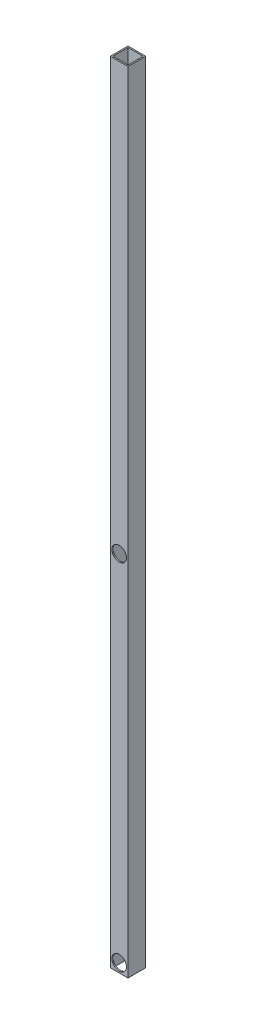
ISO-10303-21;
HEADER;
FILE_DESCRIPTION(('STEP AP214'),'2;1');
FILE_NAME('part.step','',(''),(''),'','','');
FILE_SCHEMA(('AUTOMOTIVE_DESIGN { 1 0 10303 214 1 1 1 1 }'));
ENDSEC;
DATA;
#1=APPLICATION_CONTEXT('core data for automotive mechanical design processes');
#2=APPLICATION_PROTOCOL_DEFINITION('international standard','automotive_design',2000,#1);
#3=PRODUCT_CONTEXT('',#1,'mechanical');
#4=PRODUCT('Part','Part','',(#3));
#5=PRODUCT_RELATED_PRODUCT_CATEGORY('part','',(#4));
#6=PRODUCT_DEFINITION_FORMATION('','',#4);
#7=PRODUCT_DEFINITION_CONTEXT('part definition',#1,'design');
#8=PRODUCT_DEFINITION('design','',#6,#7);
#9=PRODUCT_DEFINITION_SHAPE('','',#8);
#10=(LENGTH_UNIT() NAMED_UNIT(*) SI_UNIT(.MILLI.,.METRE.));
#11=(NAMED_UNIT(*) PLANE_ANGLE_UNIT() SI_UNIT($,.RADIAN.));
#12=(NAMED_UNIT(*) SI_UNIT($,.STERADIAN.) SOLID_ANGLE_UNIT());
#13=UNCERTAINTY_MEASURE_WITH_UNIT(LENGTH_MEASURE(1.E-05),#10,'distance_accuracy_value','');
#14=(GEOMETRIC_REPRESENTATION_CONTEXT(3) GLOBAL_UNCERTAINTY_ASSIGNED_CONTEXT((#13)) GLOBAL_UNIT_ASSIGNED_CONTEXT((#10,
#11,#12)) REPRESENTATION_CONTEXT('',''));
#15=CARTESIAN_POINT('',(0.,0.,0.));
#16=DIRECTION('',(0.,0.,1.));
#17=DIRECTION('',(1.,0.,0.));
#18=AXIS2_PLACEMENT_3D('',#15,#16,#17);
#19=CARTESIAN_POINT('',(0.,1981.2,0.));
#20=DIRECTION('',(0.,-1.,0.));
#21=DIRECTION('',(0.,0.,-1.));
#22=AXIS2_PLACEMENT_3D('',#19,#20,#21);
#23=PLANE('',#22);
#24=DIRECTION('',(0.,0.,1.));
#25=VECTOR('',#24,1.);
#26=CARTESIAN_POINT('',(0.,1981.2,0.));
#27=LINE('',#26,#25);
#28=CARTESIAN_POINT('',(0.,1981.2,-44.45));
#29=VERTEX_POINT('',#28);
#30=CARTESIAN_POINT('',(0.,1981.2,0.));
#31=VERTEX_POINT('',#30);
#32=EDGE_CURVE('E140',#29,#31,#27,.T.);
#33=ORIENTED_EDGE('',*,*,#32,.T.);
#34=DIRECTION('',(1.,0.,0.));
#35=VECTOR('',#34,1.);
#36=CARTESIAN_POINT('',(0.,1981.2,0.));
#37=LINE('',#36,#35);
#38=CARTESIAN_POINT('',(44.45,1981.2,0.));
#39=VERTEX_POINT('',#38);
#40=EDGE_CURVE('E143',#31,#39,#37,.T.);
#41=ORIENTED_EDGE('',*,*,#40,.T.);
#42=DIRECTION('',(0.,0.,-1.));
#43=VECTOR('',#42,1.);
#44=CARTESIAN_POINT('',(44.45,1981.2,0.));
#45=LINE('',#44,#43);
#46=CARTESIAN_POINT('',(44.45,1981.2,-44.45));
#47=VERTEX_POINT('',#46);
#48=EDGE_CURVE('E146',#39,#47,#45,.T.);
#49=ORIENTED_EDGE('',*,*,#48,.T.);
#50=DIRECTION('',(-1.,0.,0.));
#51=VECTOR('',#50,1.);
#52=CARTESIAN_POINT('',(0.,1981.2,-44.45));
#53=LINE('',#52,#51);
#54=EDGE_CURVE('E148',#47,#29,#53,.T.);
#55=ORIENTED_EDGE('',*,*,#54,.T.);
#56=EDGE_LOOP('',(#33,#41,#49,#55));
#57=FACE_BOUND('',#56,.T.);
#58=DIRECTION('',(1.,0.,0.));
#59=VECTOR('',#58,1.);
#60=CARTESIAN_POINT('',(3.175,1981.2,-3.175));
#61=LINE('',#60,#59);
#62=CARTESIAN_POINT('',(3.175,1981.2,-3.175));
#63=VERTEX_POINT('',#62);
#64=CARTESIAN_POINT('',(41.275,1981.2,-3.175));
#65=VERTEX_POINT('',#64);
#66=EDGE_CURVE('E102',#63,#65,#61,.T.);
#67=ORIENTED_EDGE('',*,*,#66,.F.);
#68=DIRECTION('',(0.,0.,1.));
#69=VECTOR('',#68,1.);
#70=CARTESIAN_POINT('',(3.175,1981.2,-3.175));
#71=LINE('',#70,#69);
#72=CARTESIAN_POINT('',(3.175,1981.2,-41.275));
#73=VERTEX_POINT('',#72);
#74=EDGE_CURVE('E124',#73,#63,#71,.T.);
#75=ORIENTED_EDGE('',*,*,#74,.F.);
#76=DIRECTION('',(-1.,0.,0.));
#77=VECTOR('',#76,1.);
#78=CARTESIAN_POINT('',(3.175,1981.2,-41.275));
#79=LINE('',#78,#77);
#80=CARTESIAN_POINT('',(41.275,1981.2,-41.275));
#81=VERTEX_POINT('',#80);
#82=EDGE_CURVE('E122',#81,#73,#79,.T.);
#83=ORIENTED_EDGE('',*,*,#82,.F.);
#84=DIRECTION('',(0.,0.,-1.));
#85=VECTOR('',#84,1.);
#86=CARTESIAN_POINT('',(41.275,1981.2,-3.175));
#87=LINE('',#86,#85);
#88=EDGE_CURVE('E110',#65,#81,#87,.T.);
#89=ORIENTED_EDGE('',*,*,#88,.F.);
#90=EDGE_LOOP('',(#67,#75,#83,#89));
#91=FACE_BOUND('',#90,.T.);
#92=ADVANCED_FACE('F37',(#57,#91),#23,.F.);
#93=CARTESIAN_POINT('',(0.,0.,0.));
#94=DIRECTION('',(0.,-1.,0.));
#95=DIRECTION('',(0.,0.,-1.));
#96=AXIS2_PLACEMENT_3D('',#93,#94,#95);
#97=PLANE('',#96);
#98=DIRECTION('',(0.,0.,1.));
#99=VECTOR('',#98,1.);
#100=CARTESIAN_POINT('',(0.,0.,0.));
#101=LINE('',#100,#99);
#102=CARTESIAN_POINT('',(0.,0.,-44.45));
#103=VERTEX_POINT('',#102);
#104=CARTESIAN_POINT('',(0.,0.,0.));
#105=VERTEX_POINT('',#104);
#106=EDGE_CURVE('E118',#103,#105,#101,.T.);
#107=ORIENTED_EDGE('',*,*,#106,.F.);
#108=DIRECTION('',(-1.,0.,0.));
#109=VECTOR('',#108,1.);
#110=CARTESIAN_POINT('',(0.,0.,-44.45));
#111=LINE('',#110,#109);
#112=CARTESIAN_POINT('',(44.45,0.,-44.45));
#113=VERTEX_POINT('',#112);
#114=EDGE_CURVE('E144',#113,#103,#111,.T.);
#115=ORIENTED_EDGE('',*,*,#114,.F.);
#116=DIRECTION('',(0.,0.,-1.));
#117=VECTOR('',#116,1.);
#118=CARTESIAN_POINT('',(44.45,0.,0.));
#119=LINE('',#118,#117);
#120=CARTESIAN_POINT('',(44.45,0.,0.));
#121=VERTEX_POINT('',#120);
#122=EDGE_CURVE('E155',#121,#113,#119,.T.);
#123=ORIENTED_EDGE('',*,*,#122,.F.);
#124=DIRECTION('',(1.,0.,0.));
#125=VECTOR('',#124,1.);
#126=CARTESIAN_POINT('',(0.,0.,0.));
#127=LINE('',#126,#125);
#128=EDGE_CURVE('E153',#105,#121,#127,.T.);
#129=ORIENTED_EDGE('',*,*,#128,.F.);
#130=EDGE_LOOP('',(#107,#115,#123,#129));
#131=FACE_BOUND('',#130,.T.);
#132=DIRECTION('',(0.,0.,1.));
#133=VECTOR('',#132,1.);
#134=CARTESIAN_POINT('',(3.175,0.,-3.175));
#135=LINE('',#134,#133);
#136=CARTESIAN_POINT('',(3.175,0.,-41.275));
#137=VERTEX_POINT('',#136);
#138=CARTESIAN_POINT('',(3.175,0.,-3.175));
#139=VERTEX_POINT('',#138);
#140=EDGE_CURVE('E111',#137,#139,#135,.T.);
#141=ORIENTED_EDGE('',*,*,#140,.T.);
#142=DIRECTION('',(1.,0.,0.));
#143=VECTOR('',#142,1.);
#144=CARTESIAN_POINT('',(3.175,0.,-3.175));
#145=LINE('',#144,#143);
#146=CARTESIAN_POINT('',(41.275,0.,-3.175));
#147=VERTEX_POINT('',#146);
#148=EDGE_CURVE('E60',#139,#147,#145,.T.);
#149=ORIENTED_EDGE('',*,*,#148,.T.);
#150=DIRECTION('',(0.,0.,-1.));
#151=VECTOR('',#150,1.);
#152=CARTESIAN_POINT('',(41.275,0.,-3.175));
#153=LINE('',#152,#151);
#154=CARTESIAN_POINT('',(41.275,0.,-41.275));
#155=VERTEX_POINT('',#154);
#156=EDGE_CURVE('E117',#147,#155,#153,.T.);
#157=ORIENTED_EDGE('',*,*,#156,.T.);
#158=DIRECTION('',(-1.,0.,0.));
#159=VECTOR('',#158,1.);
#160=CARTESIAN_POINT('',(3.175,0.,-41.275));
#161=LINE('',#160,#159);
#162=EDGE_CURVE('E132',#155,#137,#161,.T.);
#163=ORIENTED_EDGE('',*,*,#162,.T.);
#164=EDGE_LOOP('',(#141,#149,#157,#163));
#165=FACE_BOUND('',#164,.T.);
#166=ADVANCED_FACE('F173',(#131,#165),#97,.T.);
#167=CARTESIAN_POINT('',(0.,1981.2,0.));
#168=DIRECTION('',(1.,0.,0.));
#169=DIRECTION('',(0.,0.,-1.));
#170=AXIS2_PLACEMENT_3D('',#167,#168,#169);
#171=PLANE('',#170);
#172=ORIENTED_EDGE('',*,*,#106,.T.);
#173=DIRECTION('',(0.,-1.,0.));
#174=VECTOR('',#173,1.);
#175=CARTESIAN_POINT('',(0.,1981.2,0.));
#176=LINE('',#175,#174);
#177=EDGE_CURVE('E11',#31,#105,#176,.T.);
#178=ORIENTED_EDGE('',*,*,#177,.F.);
#179=ORIENTED_EDGE('',*,*,#32,.F.);
#180=DIRECTION('',(0.,-1.,0.));
#181=VECTOR('',#180,1.);
#182=CARTESIAN_POINT('',(0.,1981.2,-44.45));
#183=LINE('',#182,#181);
#184=EDGE_CURVE('E150',#29,#103,#183,.T.);
#185=ORIENTED_EDGE('',*,*,#184,.T.);
#186=EDGE_LOOP('',(#172,#178,#179,#185));
#187=FACE_BOUND('',#186,.T.);
#188=ADVANCED_FACE('F39',(#187),#171,.F.);
#189=CARTESIAN_POINT('',(0.,1981.2,0.));
#190=DIRECTION('',(0.,0.,-1.));
#191=DIRECTION('',(-1.,0.,0.));
#192=AXIS2_PLACEMENT_3D('',#189,#190,#191);
#193=PLANE('',#192);
#194=CARTESIAN_POINT('',(22.225,22.225,0.));
#195=DIRECTION('',(0.,0.,1.));
#196=DIRECTION('',(1.,0.,0.));
#197=AXIS2_PLACEMENT_3D('',#194,#195,#196);
#198=CIRCLE('',#197,18.25625);
#199=CARTESIAN_POINT('',(40.48125,22.225,0.));
#200=VERTEX_POINT('',#199);
#201=EDGE_CURVE('E130',#200,#200,#198,.T.);
#202=ORIENTED_EDGE('',*,*,#201,.F.);
#203=EDGE_LOOP('',(#202));
#204=FACE_BOUND('',#203,.T.);
#205=CARTESIAN_POINT('',(22.225,911.225,0.));
#206=DIRECTION('',(0.,0.,1.));
#207=DIRECTION('',(1.,0.,0.));
#208=AXIS2_PLACEMENT_3D('',#205,#206,#207);
#209=CIRCLE('',#208,18.25625);
#210=CARTESIAN_POINT('',(40.48125,911.225,0.));
#211=VERTEX_POINT('',#210);
#212=EDGE_CURVE('E231',#211,#211,#209,.T.);
#213=ORIENTED_EDGE('',*,*,#212,.F.);
#214=EDGE_LOOP('',(#213));
#215=FACE_BOUND('',#214,.T.);
#216=ORIENTED_EDGE('',*,*,#128,.T.);
#217=DIRECTION('',(0.,-1.,0.));
#218=VECTOR('',#217,1.);
#219=CARTESIAN_POINT('',(44.45,1981.2,0.));
#220=LINE('',#219,#218);
#221=EDGE_CURVE('E45',#39,#121,#220,.T.);
#222=ORIENTED_EDGE('',*,*,#221,.F.);
#223=ORIENTED_EDGE('',*,*,#40,.F.);
#224=ORIENTED_EDGE('',*,*,#177,.T.);
#225=EDGE_LOOP('',(#216,#222,#223,#224));
#226=FACE_BOUND('',#225,.T.);
#227=ADVANCED_FACE('F183',(#204,#215,#226),#193,.F.);
#228=CARTESIAN_POINT('',(44.45,1981.2,0.));
#229=DIRECTION('',(-1.,0.,0.));
#230=DIRECTION('',(0.,0.,1.));
#231=AXIS2_PLACEMENT_3D('',#228,#229,#230);
#232=PLANE('',#231);
#233=ORIENTED_EDGE('',*,*,#122,.T.);
#234=DIRECTION('',(0.,-1.,0.));
#235=VECTOR('',#234,1.);
#236=CARTESIAN_POINT('',(44.45,1981.2,-44.45));
#237=LINE('',#236,#235);
#238=EDGE_CURVE('E160',#47,#113,#237,.T.);
#239=ORIENTED_EDGE('',*,*,#238,.F.);
#240=ORIENTED_EDGE('',*,*,#48,.F.);
#241=ORIENTED_EDGE('',*,*,#221,.T.);
#242=EDGE_LOOP('',(#233,#239,#240,#241));
#243=FACE_BOUND('',#242,.T.);
#244=ADVANCED_FACE('F167',(#243),#232,.F.);
#245=CARTESIAN_POINT('',(0.,1981.2,-44.45));
#246=DIRECTION('',(0.,0.,1.));
#247=DIRECTION('',(1.,0.,0.));
#248=AXIS2_PLACEMENT_3D('',#245,#246,#247);
#249=PLANE('',#248);
#250=CARTESIAN_POINT('',(22.225,911.225,-44.45));
#251=DIRECTION('',(0.,0.,-1.));
#252=DIRECTION('',(-1.,0.,0.));
#253=AXIS2_PLACEMENT_3D('',#250,#251,#252);
#254=CIRCLE('',#253,12.7);
#255=CARTESIAN_POINT('',(9.525,911.225,-44.45));
#256=VERTEX_POINT('',#255);
#257=EDGE_CURVE('E214',#256,#256,#254,.T.);
#258=ORIENTED_EDGE('',*,*,#257,.F.);
#259=EDGE_LOOP('',(#258));
#260=FACE_BOUND('',#259,.T.);
#261=CARTESIAN_POINT('',(22.225,22.225,-44.45));
#262=DIRECTION('',(0.,0.,-1.));
#263=DIRECTION('',(-1.,0.,0.));
#264=AXIS2_PLACEMENT_3D('',#261,#262,#263);
#265=CIRCLE('',#264,12.7);
#266=CARTESIAN_POINT('',(9.525,22.225,-44.45));
#267=VERTEX_POINT('',#266);
#268=EDGE_CURVE('E217',#267,#267,#265,.T.);
#269=ORIENTED_EDGE('',*,*,#268,.F.);
#270=EDGE_LOOP('',(#269));
#271=FACE_BOUND('',#270,.T.);
#272=ORIENTED_EDGE('',*,*,#114,.T.);
#273=ORIENTED_EDGE('',*,*,#184,.F.);
#274=ORIENTED_EDGE('',*,*,#54,.F.);
#275=ORIENTED_EDGE('',*,*,#238,.T.);
#276=EDGE_LOOP('',(#272,#273,#274,#275));
#277=FACE_BOUND('',#276,.T.);
#278=ADVANCED_FACE('F177',(#260,#271,#277),#249,.F.);
#279=CARTESIAN_POINT('',(3.175,1981.2,-3.175));
#280=DIRECTION('',(0.,0.,-1.));
#281=DIRECTION('',(-1.,0.,0.));
#282=AXIS2_PLACEMENT_3D('',#279,#280,#281);
#283=PLANE('',#282);
#284=CARTESIAN_POINT('',(22.225,22.225,-3.175));
#285=DIRECTION('',(0.,0.,-1.));
#286=DIRECTION('',(-1.,0.,0.));
#287=AXIS2_PLACEMENT_3D('',#284,#285,#286);
#288=CIRCLE('',#287,18.25625);
#289=CARTESIAN_POINT('',(3.96875,22.225,-3.175));
#290=VERTEX_POINT('',#289);
#291=EDGE_CURVE('E228',#290,#290,#288,.F.);
#292=ORIENTED_EDGE('',*,*,#291,.T.);
#293=EDGE_LOOP('',(#292));
#294=FACE_BOUND('',#293,.T.);
#295=CARTESIAN_POINT('',(22.225,911.225,-3.175));
#296=DIRECTION('',(0.,0.,-1.));
#297=DIRECTION('',(-1.,0.,0.));
#298=AXIS2_PLACEMENT_3D('',#295,#296,#297);
#299=CIRCLE('',#298,18.25625);
#300=CARTESIAN_POINT('',(3.96875,911.225,-3.175));
#301=VERTEX_POINT('',#300);
#302=EDGE_CURVE('E234',#301,#301,#299,.F.);
#303=ORIENTED_EDGE('',*,*,#302,.T.);
#304=EDGE_LOOP('',(#303));
#305=FACE_BOUND('',#304,.T.);
#306=ORIENTED_EDGE('',*,*,#148,.F.);
#307=DIRECTION('',(0.,-1.,0.));
#308=VECTOR('',#307,1.);
#309=CARTESIAN_POINT('',(3.175,1981.2,-3.175));
#310=LINE('',#309,#308);
#311=EDGE_CURVE('E106',#63,#139,#310,.T.);
#312=ORIENTED_EDGE('',*,*,#311,.F.);
#313=ORIENTED_EDGE('',*,*,#66,.T.);
#314=DIRECTION('',(0.,-1.,0.));
#315=VECTOR('',#314,1.);
#316=CARTESIAN_POINT('',(41.275,1981.2,-3.175));
#317=LINE('',#316,#315);
#318=EDGE_CURVE('E105',#65,#147,#317,.T.);
#319=ORIENTED_EDGE('',*,*,#318,.T.);
#320=EDGE_LOOP('',(#306,#312,#313,#319));
#321=FACE_BOUND('',#320,.T.);
#322=ADVANCED_FACE('F104',(#294,#305,#321),#283,.T.);
#323=CARTESIAN_POINT('',(41.275,1981.2,-3.175));
#324=DIRECTION('',(-1.,0.,0.));
#325=DIRECTION('',(0.,0.,1.));
#326=AXIS2_PLACEMENT_3D('',#323,#324,#325);
#327=PLANE('',#326);
#328=ORIENTED_EDGE('',*,*,#156,.F.);
#329=ORIENTED_EDGE('',*,*,#318,.F.);
#330=ORIENTED_EDGE('',*,*,#88,.T.);
#331=DIRECTION('',(0.,-1.,0.));
#332=VECTOR('',#331,1.);
#333=CARTESIAN_POINT('',(41.275,1981.2,-41.275));
#334=LINE('',#333,#332);
#335=EDGE_CURVE('E119',#81,#155,#334,.T.);
#336=ORIENTED_EDGE('',*,*,#335,.T.);
#337=EDGE_LOOP('',(#328,#329,#330,#336));
#338=FACE_BOUND('',#337,.T.);
#339=ADVANCED_FACE('F114',(#338),#327,.T.);
#340=CARTESIAN_POINT('',(3.175,1981.2,-41.275));
#341=DIRECTION('',(0.,0.,1.));
#342=DIRECTION('',(1.,0.,0.));
#343=AXIS2_PLACEMENT_3D('',#340,#341,#342);
#344=PLANE('',#343);
#345=CARTESIAN_POINT('',(22.225,911.225,-41.275));
#346=DIRECTION('',(0.,0.,1.));
#347=DIRECTION('',(1.,0.,0.));
#348=AXIS2_PLACEMENT_3D('',#345,#346,#347);
#349=CIRCLE('',#348,12.7);
#350=CARTESIAN_POINT('',(34.925,911.225,-41.275));
#351=VERTEX_POINT('',#350);
#352=EDGE_CURVE('E219',#351,#351,#349,.F.);
#353=ORIENTED_EDGE('',*,*,#352,.T.);
#354=EDGE_LOOP('',(#353));
#355=FACE_BOUND('',#354,.T.);
#356=CARTESIAN_POINT('',(22.225,22.225,-41.275));
#357=DIRECTION('',(0.,0.,1.));
#358=DIRECTION('',(1.,0.,0.));
#359=AXIS2_PLACEMENT_3D('',#356,#357,#358);
#360=CIRCLE('',#359,12.7);
#361=CARTESIAN_POINT('',(34.925,22.225,-41.275));
#362=VERTEX_POINT('',#361);
#363=EDGE_CURVE('E220',#362,#362,#360,.F.);
#364=ORIENTED_EDGE('',*,*,#363,.T.);
#365=EDGE_LOOP('',(#364));
#366=FACE_BOUND('',#365,.T.);
#367=ORIENTED_EDGE('',*,*,#162,.F.);
#368=ORIENTED_EDGE('',*,*,#335,.F.);
#369=ORIENTED_EDGE('',*,*,#82,.T.);
#370=DIRECTION('',(0.,-1.,0.));
#371=VECTOR('',#370,1.);
#372=CARTESIAN_POINT('',(3.175,1981.2,-41.275));
#373=LINE('',#372,#371);
#374=EDGE_CURVE('E52',#73,#137,#373,.T.);
#375=ORIENTED_EDGE('',*,*,#374,.T.);
#376=EDGE_LOOP('',(#367,#368,#369,#375));
#377=FACE_BOUND('',#376,.T.);
#378=ADVANCED_FACE('F250',(#355,#366,#377),#344,.T.);
#379=CARTESIAN_POINT('',(3.175,1981.2,-3.175));
#380=DIRECTION('',(1.,0.,0.));
#381=DIRECTION('',(0.,0.,-1.));
#382=AXIS2_PLACEMENT_3D('',#379,#380,#381);
#383=PLANE('',#382);
#384=ORIENTED_EDGE('',*,*,#140,.F.);
#385=ORIENTED_EDGE('',*,*,#374,.F.);
#386=ORIENTED_EDGE('',*,*,#74,.T.);
#387=ORIENTED_EDGE('',*,*,#311,.T.);
#388=EDGE_LOOP('',(#384,#385,#386,#387));
#389=FACE_BOUND('',#388,.T.);
#390=ADVANCED_FACE('F242',(#389),#383,.T.);
#391=CARTESIAN_POINT('',(22.225,911.225,-44.451));
#392=DIRECTION('',(0.,0.,1.));
#393=DIRECTION('',(1.,0.,0.));
#394=AXIS2_PLACEMENT_3D('',#391,#392,#393);
#395=CYLINDRICAL_SURFACE('',#394,18.25625);
#396=ORIENTED_EDGE('',*,*,#302,.F.);
#397=EDGE_LOOP('',(#396));
#398=FACE_BOUND('',#397,.T.);
#399=ORIENTED_EDGE('',*,*,#212,.T.);
#400=EDGE_LOOP('',(#399));
#401=FACE_BOUND('',#400,.T.);
#402=ADVANCED_FACE('F239',(#398,#401),#395,.F.);
#403=CARTESIAN_POINT('',(22.225,22.225,-44.451));
#404=DIRECTION('',(0.,0.,1.));
#405=DIRECTION('',(1.,0.,0.));
#406=AXIS2_PLACEMENT_3D('',#403,#404,#405);
#407=CYLINDRICAL_SURFACE('',#406,18.25625);
#408=ORIENTED_EDGE('',*,*,#291,.F.);
#409=EDGE_LOOP('',(#408));
#410=FACE_BOUND('',#409,.T.);
#411=ORIENTED_EDGE('',*,*,#201,.T.);
#412=EDGE_LOOP('',(#411));
#413=FACE_BOUND('',#412,.T.);
#414=ADVANCED_FACE('F241',(#410,#413),#407,.F.);
#415=CARTESIAN_POINT('',(22.225,22.225,0.001000000000001));
#416=DIRECTION('',(0.,0.,-1.));
#417=DIRECTION('',(-1.,0.,0.));
#418=AXIS2_PLACEMENT_3D('',#415,#416,#417);
#419=CYLINDRICAL_SURFACE('',#418,12.7);
#420=ORIENTED_EDGE('',*,*,#363,.F.);
#421=EDGE_LOOP('',(#420));
#422=FACE_BOUND('',#421,.T.);
#423=ORIENTED_EDGE('',*,*,#268,.T.);
#424=EDGE_LOOP('',(#423));
#425=FACE_BOUND('',#424,.T.);
#426=ADVANCED_FACE('F247',(#422,#425),#419,.F.);
#427=CARTESIAN_POINT('',(22.225,911.225,0.001000000000001));
#428=DIRECTION('',(0.,0.,-1.));
#429=DIRECTION('',(-1.,0.,0.));
#430=AXIS2_PLACEMENT_3D('',#427,#428,#429);
#431=CYLINDRICAL_SURFACE('',#430,12.7);
#432=ORIENTED_EDGE('',*,*,#352,.F.);
#433=EDGE_LOOP('',(#432));
#434=FACE_BOUND('',#433,.T.);
#435=ORIENTED_EDGE('',*,*,#257,.T.);
#436=EDGE_LOOP('',(#435));
#437=FACE_BOUND('',#436,.T.);
#438=ADVANCED_FACE('F282',(#434,#437),#431,.F.);
#439=CLOSED_SHELL('',(#92,#166,#188,#227,#244,#278,#322,#339,#378,#390,#402,#414,#426,#438));
#440=MANIFOLD_SOLID_BREP('B2',#439);
#441=ADVANCED_BREP_SHAPE_REPRESENTATION('',(#18,#440),#14);
#442=SHAPE_DEFINITION_REPRESENTATION(#9,#441);
ENDSEC;
END-ISO-10303-21;
